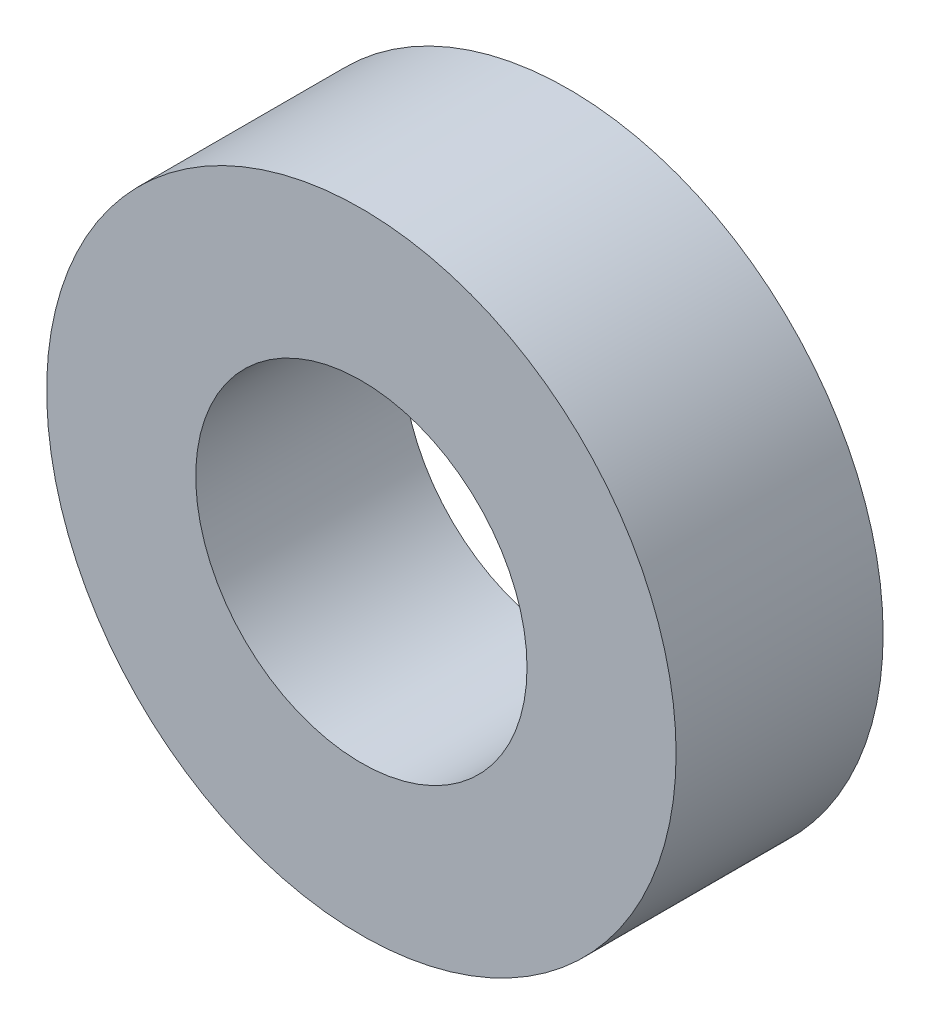
ISO-10303-21;
HEADER;
FILE_DESCRIPTION(('STEP AP214'),'2;1');
FILE_NAME('part.step','',(''),(''),'','','');
FILE_SCHEMA(('AUTOMOTIVE_DESIGN { 1 0 10303 214 1 1 1 1 }'));
ENDSEC;
DATA;
#1=APPLICATION_CONTEXT('core data for automotive mechanical design processes');
#2=APPLICATION_PROTOCOL_DEFINITION('international standard','automotive_design',2000,#1);
#3=PRODUCT_CONTEXT('',#1,'mechanical');
#4=PRODUCT('Part','Part','',(#3));
#5=PRODUCT_RELATED_PRODUCT_CATEGORY('part','',(#4));
#6=PRODUCT_DEFINITION_FORMATION('','',#4);
#7=PRODUCT_DEFINITION_CONTEXT('part definition',#1,'design');
#8=PRODUCT_DEFINITION('design','',#6,#7);
#9=PRODUCT_DEFINITION_SHAPE('','',#8);
#10=(LENGTH_UNIT() NAMED_UNIT(*) SI_UNIT(.MILLI.,.METRE.));
#11=(NAMED_UNIT(*) PLANE_ANGLE_UNIT() SI_UNIT($,.RADIAN.));
#12=(NAMED_UNIT(*) SI_UNIT($,.STERADIAN.) SOLID_ANGLE_UNIT());
#13=UNCERTAINTY_MEASURE_WITH_UNIT(LENGTH_MEASURE(1.E-05),#10,'distance_accuracy_value','');
#14=(GEOMETRIC_REPRESENTATION_CONTEXT(3) GLOBAL_UNCERTAINTY_ASSIGNED_CONTEXT((#13)) GLOBAL_UNIT_ASSIGNED_CONTEXT((#10,
#11,#12)) REPRESENTATION_CONTEXT('',''));
#15=CARTESIAN_POINT('',(0.,0.,0.));
#16=DIRECTION('',(0.,0.,1.));
#17=DIRECTION('',(1.,0.,0.));
#18=AXIS2_PLACEMENT_3D('',#15,#16,#17);
#19=CARTESIAN_POINT('',(0.,0.,-1.5625));
#20=DIRECTION('',(0.,0.,1.));
#21=DIRECTION('',(1.,0.,0.));
#22=AXIS2_PLACEMENT_3D('',#19,#20,#21);
#23=CYLINDRICAL_SURFACE('',#22,2.5);
#24=CARTESIAN_POINT('',(0.,0.,1.5625));
#25=DIRECTION('',(0.,0.,1.));
#26=DIRECTION('',(1.,0.,0.));
#27=AXIS2_PLACEMENT_3D('',#24,#25,#26);
#28=CIRCLE('',#27,2.5);
#29=CARTESIAN_POINT('',(2.5,0.,1.5625));
#30=VERTEX_POINT('',#29);
#31=EDGE_CURVE('E28',#30,#30,#28,.F.);
#32=ORIENTED_EDGE('',*,*,#31,.F.);
#33=EDGE_LOOP('',(#32));
#34=FACE_BOUND('',#33,.T.);
#35=CARTESIAN_POINT('',(0.,0.,-1.5625));
#36=DIRECTION('',(0.,0.,1.));
#37=DIRECTION('',(1.,0.,0.));
#38=AXIS2_PLACEMENT_3D('',#35,#36,#37);
#39=CIRCLE('',#38,2.5);
#40=CARTESIAN_POINT('',(2.5,0.,-1.5625));
#41=VERTEX_POINT('',#40);
#42=EDGE_CURVE('E19',#41,#41,#39,.F.);
#43=ORIENTED_EDGE('',*,*,#42,.T.);
#44=EDGE_LOOP('',(#43));
#45=FACE_BOUND('',#44,.T.);
#46=ADVANCED_FACE('F16',(#34,#45),#23,.F.);
#47=CARTESIAN_POINT('',(0.,0.,-1.5625));
#48=DIRECTION('',(0.,0.,1.));
#49=DIRECTION('',(1.,0.,0.));
#50=AXIS2_PLACEMENT_3D('',#47,#48,#49);
#51=PLANE('',#50);
#52=ORIENTED_EDGE('',*,*,#42,.F.);
#53=EDGE_LOOP('',(#52));
#54=FACE_BOUND('',#53,.T.);
#55=CARTESIAN_POINT('',(0.,0.,-1.5625));
#56=DIRECTION('',(0.,0.,1.));
#57=DIRECTION('',(1.,0.,0.));
#58=AXIS2_PLACEMENT_3D('',#55,#56,#57);
#59=CIRCLE('',#58,4.75);
#60=CARTESIAN_POINT('',(4.75,0.,-1.5625));
#61=VERTEX_POINT('',#60);
#62=EDGE_CURVE('E23',#61,#61,#59,.T.);
#63=ORIENTED_EDGE('',*,*,#62,.F.);
#64=EDGE_LOOP('',(#63));
#65=FACE_BOUND('',#64,.T.);
#66=ADVANCED_FACE('F37',(#54,#65),#51,.F.);
#67=CARTESIAN_POINT('',(0.,0.,1.5625));
#68=DIRECTION('',(0.,0.,1.));
#69=DIRECTION('',(1.,0.,0.));
#70=AXIS2_PLACEMENT_3D('',#67,#68,#69);
#71=PLANE('',#70);
#72=ORIENTED_EDGE('',*,*,#31,.T.);
#73=EDGE_LOOP('',(#72));
#74=FACE_BOUND('',#73,.T.);
#75=CARTESIAN_POINT('',(0.,0.,1.5625));
#76=DIRECTION('',(0.,0.,1.));
#77=DIRECTION('',(1.,0.,0.));
#78=AXIS2_PLACEMENT_3D('',#75,#76,#77);
#79=CIRCLE('',#78,4.75);
#80=CARTESIAN_POINT('',(4.75,0.,1.5625));
#81=VERTEX_POINT('',#80);
#82=EDGE_CURVE('E10',#81,#81,#79,.F.);
#83=ORIENTED_EDGE('',*,*,#82,.F.);
#84=EDGE_LOOP('',(#83));
#85=FACE_BOUND('',#84,.T.);
#86=ADVANCED_FACE('F40',(#74,#85),#71,.T.);
#87=CARTESIAN_POINT('',(0.,0.,-1.5625));
#88=DIRECTION('',(0.,0.,1.));
#89=DIRECTION('',(1.,0.,0.));
#90=AXIS2_PLACEMENT_3D('',#87,#88,#89);
#91=CYLINDRICAL_SURFACE('',#90,4.75);
#92=ORIENTED_EDGE('',*,*,#82,.T.);
#93=EDGE_LOOP('',(#92));
#94=FACE_BOUND('',#93,.T.);
#95=ORIENTED_EDGE('',*,*,#62,.T.);
#96=EDGE_LOOP('',(#95));
#97=FACE_BOUND('',#96,.T.);
#98=ADVANCED_FACE('F43',(#94,#97),#91,.T.);
#99=CLOSED_SHELL('',(#46,#66,#86,#98));
#100=MANIFOLD_SOLID_BREP('B1',#99);
#101=ADVANCED_BREP_SHAPE_REPRESENTATION('',(#18,#100),#14);
#102=SHAPE_DEFINITION_REPRESENTATION(#9,#101);
ENDSEC;
END-ISO-10303-21;
